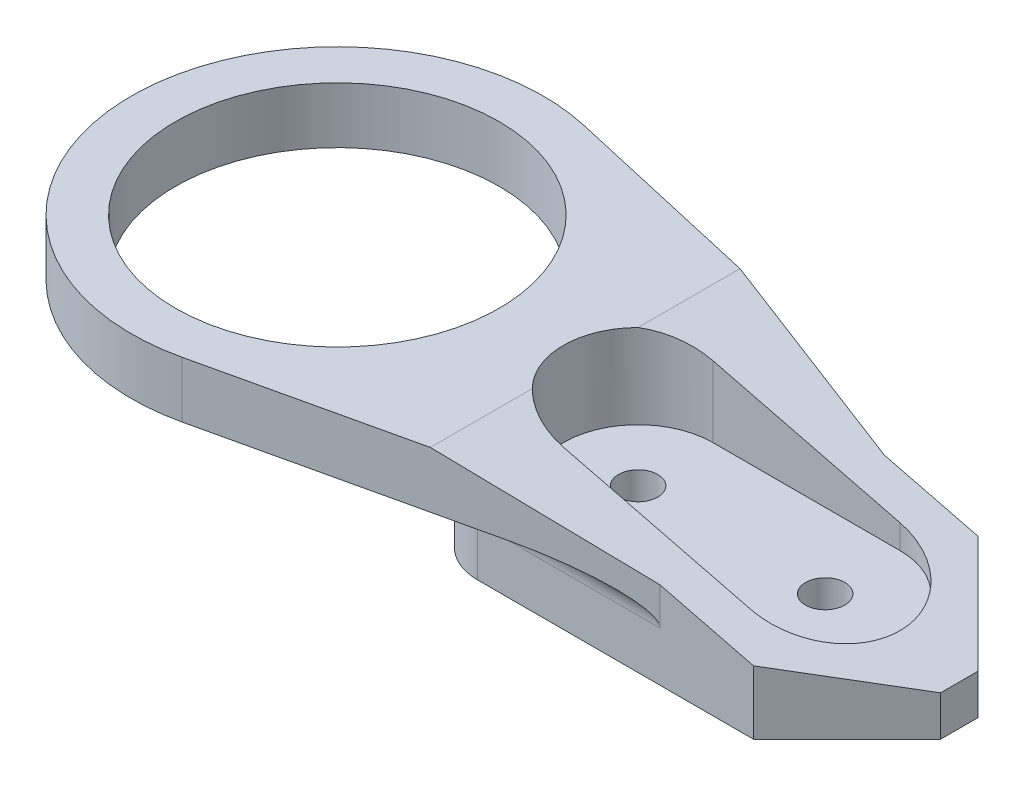
ISO-10303-21;
HEADER;
FILE_DESCRIPTION(('STEP AP214'),'2;1');
FILE_NAME('part.step','',(''),(''),'','','');
FILE_SCHEMA(('AUTOMOTIVE_DESIGN { 1 0 10303 214 1 1 1 1 }'));
ENDSEC;
DATA;
#1=APPLICATION_CONTEXT('core data for automotive mechanical design processes');
#2=APPLICATION_PROTOCOL_DEFINITION('international standard','automotive_design',2000,#1);
#3=PRODUCT_CONTEXT('',#1,'mechanical');
#4=PRODUCT('Part','Part','',(#3));
#5=PRODUCT_RELATED_PRODUCT_CATEGORY('part','',(#4));
#6=PRODUCT_DEFINITION_FORMATION('','',#4);
#7=PRODUCT_DEFINITION_CONTEXT('part definition',#1,'design');
#8=PRODUCT_DEFINITION('design','',#6,#7);
#9=PRODUCT_DEFINITION_SHAPE('','',#8);
#10=(LENGTH_UNIT() NAMED_UNIT(*) SI_UNIT(.MILLI.,.METRE.));
#11=(NAMED_UNIT(*) PLANE_ANGLE_UNIT() SI_UNIT($,.RADIAN.));
#12=(NAMED_UNIT(*) SI_UNIT($,.STERADIAN.) SOLID_ANGLE_UNIT());
#13=UNCERTAINTY_MEASURE_WITH_UNIT(LENGTH_MEASURE(1.E-05),#10,'distance_accuracy_value','');
#14=(GEOMETRIC_REPRESENTATION_CONTEXT(3) GLOBAL_UNCERTAINTY_ASSIGNED_CONTEXT((#13)) GLOBAL_UNIT_ASSIGNED_CONTEXT((#10,
#11,#12)) REPRESENTATION_CONTEXT('',''));
#15=CARTESIAN_POINT('',(0.,0.,0.));
#16=DIRECTION('',(0.,0.,1.));
#17=DIRECTION('',(1.,0.,0.));
#18=AXIS2_PLACEMENT_3D('',#15,#16,#17);
#19=CARTESIAN_POINT('',(17.8298933663439,-2.85,6.));
#20=DIRECTION('',(0.,1.,0.));
#21=DIRECTION('',(0.,0.,1.));
#22=AXIS2_PLACEMENT_3D('',#19,#20,#21);
#23=CYLINDRICAL_SURFACE('',#22,1.05);
#24=CARTESIAN_POINT('',(17.8298933663439,0.,6.));
#25=DIRECTION('',(0.,1.,0.));
#26=DIRECTION('',(-1.,0.,0.));
#27=AXIS2_PLACEMENT_3D('',#24,#25,#26);
#28=CIRCLE('',#27,1.05);
#29=CARTESIAN_POINT('',(16.7798933663439,0.,6.));
#30=VERTEX_POINT('',#29);
#31=EDGE_CURVE('E235',#30,#30,#28,.T.);
#32=ORIENTED_EDGE('',*,*,#31,.F.);
#33=EDGE_LOOP('',(#32));
#34=FACE_BOUND('',#33,.T.);
#35=CARTESIAN_POINT('',(17.8298933663439,2.65,6.));
#36=DIRECTION('',(0.,1.,0.));
#37=DIRECTION('',(0.,0.,1.));
#38=AXIS2_PLACEMENT_3D('',#35,#36,#37);
#39=CIRCLE('',#38,1.05);
#40=CARTESIAN_POINT('',(17.8298933663439,2.65,7.05));
#41=VERTEX_POINT('',#40);
#42=EDGE_CURVE('E232',#41,#41,#39,.F.);
#43=ORIENTED_EDGE('',*,*,#42,.F.);
#44=EDGE_LOOP('',(#43));
#45=FACE_BOUND('',#44,.T.);
#46=ADVANCED_FACE('F47',(#34,#45),#23,.F.);
#47=CARTESIAN_POINT('',(7.82989336634394,-2.85,6.));
#48=DIRECTION('',(0.,1.,0.));
#49=DIRECTION('',(0.,0.,1.));
#50=AXIS2_PLACEMENT_3D('',#47,#48,#49);
#51=CYLINDRICAL_SURFACE('',#50,1.05);
#52=CARTESIAN_POINT('',(7.82989336634394,0.,6.));
#53=DIRECTION('',(0.,1.,0.));
#54=DIRECTION('',(-1.,0.,0.));
#55=AXIS2_PLACEMENT_3D('',#52,#53,#54);
#56=CIRCLE('',#55,1.05);
#57=CARTESIAN_POINT('',(6.77989336634394,0.,6.));
#58=VERTEX_POINT('',#57);
#59=EDGE_CURVE('E238',#58,#58,#56,.T.);
#60=ORIENTED_EDGE('',*,*,#59,.F.);
#61=EDGE_LOOP('',(#60));
#62=FACE_BOUND('',#61,.T.);
#63=CARTESIAN_POINT('',(7.82989336634394,2.65,6.));
#64=DIRECTION('',(0.,1.,0.));
#65=DIRECTION('',(0.,0.,1.));
#66=AXIS2_PLACEMENT_3D('',#63,#64,#65);
#67=CIRCLE('',#66,1.05);
#68=CARTESIAN_POINT('',(7.82989336634394,2.65,7.05));
#69=VERTEX_POINT('',#68);
#70=EDGE_CURVE('E227',#69,#69,#67,.F.);
#71=ORIENTED_EDGE('',*,*,#70,.F.);
#72=EDGE_LOOP('',(#71));
#73=FACE_BOUND('',#72,.T.);
#74=ADVANCED_FACE('F467',(#62,#73),#51,.F.);
#75=CARTESIAN_POINT('',(0.,0.,12.));
#76=DIRECTION('',(0.,0.,-1.));
#77=DIRECTION('',(-1.,0.,0.));
#78=AXIS2_PLACEMENT_3D('',#75,#76,#77);
#79=PLANE('',#78);
#80=DIRECTION('',(0.,1.,0.));
#81=VECTOR('',#80,1.);
#82=CARTESIAN_POINT('',(15.,4.15,12.));
#83=LINE('',#82,#81);
#84=CARTESIAN_POINT('',(15.,2.65,12.));
#85=VERTEX_POINT('',#84);
#86=CARTESIAN_POINT('',(15.,4.64999999999996,12.));
#87=VERTEX_POINT('',#86);
#88=EDGE_CURVE('E267',#85,#87,#83,.T.);
#89=ORIENTED_EDGE('',*,*,#88,.F.);
#90=DIRECTION('',(1.,0.,0.));
#91=VECTOR('',#90,1.);
#92=CARTESIAN_POINT('',(5.25,2.65,12.));
#93=LINE('',#92,#91);
#94=CARTESIAN_POINT('',(5.25,2.65,12.));
#95=VERTEX_POINT('',#94);
#96=EDGE_CURVE('E351',#85,#95,#93,.F.);
#97=ORIENTED_EDGE('',*,*,#96,.T.);
#98=DIRECTION('',(0.,1.,0.));
#99=VECTOR('',#98,1.);
#100=CARTESIAN_POINT('',(5.25,0.,12.));
#101=LINE('',#100,#99);
#102=CARTESIAN_POINT('',(5.25,0.,12.));
#103=VERTEX_POINT('',#102);
#104=EDGE_CURVE('E332',#95,#103,#101,.F.);
#105=ORIENTED_EDGE('',*,*,#104,.T.);
#106=DIRECTION('',(1.,0.,0.));
#107=VECTOR('',#106,1.);
#108=CARTESIAN_POINT('',(25.,0.,12.));
#109=LINE('',#108,#107);
#110=CARTESIAN_POINT('',(20.,0.,12.));
#111=VERTEX_POINT('',#110);
#112=EDGE_CURVE('E275',#103,#111,#109,.T.);
#113=ORIENTED_EDGE('',*,*,#112,.T.);
#114=DIRECTION('',(0.,1.,0.));
#115=VECTOR('',#114,1.);
#116=CARTESIAN_POINT('',(20.,0.,12.));
#117=LINE('',#116,#115);
#118=CARTESIAN_POINT('',(20.,3.39999999999998,12.));
#119=VERTEX_POINT('',#118);
#120=EDGE_CURVE('E297',#111,#119,#117,.T.);
#121=ORIENTED_EDGE('',*,*,#120,.T.);
#122=DIRECTION('',(0.970142500145333,-0.24253562503633,0.));
#123=VECTOR('',#122,1.);
#124=CARTESIAN_POINT('',(4.99999999999971,7.15,12.));
#125=LINE('',#124,#123);
#126=EDGE_CURVE('E293',#119,#87,#125,.F.);
#127=ORIENTED_EDGE('',*,*,#126,.T.);
#128=EDGE_LOOP('',(#89,#97,#105,#113,#121,#127));
#129=FACE_BOUND('',#128,.T.);
#130=ADVANCED_FACE('F448',(#129),#79,.F.);
#131=CARTESIAN_POINT('',(25.,0.,12.));
#132=DIRECTION('',(0.,1.,0.));
#133=DIRECTION('',(-1.,0.,0.));
#134=AXIS2_PLACEMENT_3D('',#131,#132,#133);
#135=PLANE('',#134);
#136=ORIENTED_EDGE('',*,*,#59,.T.);
#137=EDGE_LOOP('',(#136));
#138=FACE_BOUND('',#137,.T.);
#139=ORIENTED_EDGE('',*,*,#31,.T.);
#140=EDGE_LOOP('',(#139));
#141=FACE_BOUND('',#140,.T.);
#142=ORIENTED_EDGE('',*,*,#112,.F.);
#143=CARTESIAN_POINT('',(5.25,0.,9.));
#144=DIRECTION('',(0.,1.,0.));
#145=DIRECTION('',(-1.,0.,0.));
#146=AXIS2_PLACEMENT_3D('',#143,#144,#145);
#147=CIRCLE('',#146,3.);
#148=CARTESIAN_POINT('',(2.25,0.,9.));
#149=VERTEX_POINT('',#148);
#150=EDGE_CURVE('E336',#103,#149,#147,.F.);
#151=ORIENTED_EDGE('',*,*,#150,.T.);
#152=DIRECTION('',(0.,0.,1.));
#153=VECTOR('',#152,1.);
#154=CARTESIAN_POINT('',(2.25,0.,12.));
#155=LINE('',#154,#153);
#156=CARTESIAN_POINT('',(2.25,0.,3.));
#157=VERTEX_POINT('',#156);
#158=EDGE_CURVE('E247',#157,#149,#155,.T.);
#159=ORIENTED_EDGE('',*,*,#158,.F.);
#160=CARTESIAN_POINT('',(5.25,0.,3.));
#161=DIRECTION('',(0.,1.,0.));
#162=DIRECTION('',(-1.,0.,0.));
#163=AXIS2_PLACEMENT_3D('',#160,#161,#162);
#164=CIRCLE('',#163,3.);
#165=CARTESIAN_POINT('',(5.25,0.,0.));
#166=VERTEX_POINT('',#165);
#167=EDGE_CURVE('E334',#157,#166,#164,.F.);
#168=ORIENTED_EDGE('',*,*,#167,.T.);
#169=DIRECTION('',(1.,0.,0.));
#170=VECTOR('',#169,1.);
#171=CARTESIAN_POINT('',(25.,0.,0.));
#172=LINE('',#171,#170);
#173=CARTESIAN_POINT('',(20.,0.,0.));
#174=VERTEX_POINT('',#173);
#175=EDGE_CURVE('E266',#166,#174,#172,.T.);
#176=ORIENTED_EDGE('',*,*,#175,.T.);
#177=DIRECTION('',(0.707106781186549,0.,0.707106781186547));
#178=VECTOR('',#177,1.);
#179=CARTESIAN_POINT('',(25.,0.,5.00000000000001));
#180=LINE('',#179,#178);
#181=CARTESIAN_POINT('',(25.,0.,5.00000000000001));
#182=VERTEX_POINT('',#181);
#183=EDGE_CURVE('E309',#174,#182,#180,.T.);
#184=ORIENTED_EDGE('',*,*,#183,.T.);
#185=DIRECTION('',(0.,0.,-1.));
#186=VECTOR('',#185,1.);
#187=CARTESIAN_POINT('',(25.,0.,12.));
#188=LINE('',#187,#186);
#189=CARTESIAN_POINT('',(25.,0.,6.99999999999997));
#190=VERTEX_POINT('',#189);
#191=EDGE_CURVE('E277',#190,#182,#188,.T.);
#192=ORIENTED_EDGE('',*,*,#191,.F.);
#193=DIRECTION('',(0.707106781186547,0.,-0.707106781186549));
#194=VECTOR('',#193,1.);
#195=CARTESIAN_POINT('',(20.,0.,12.));
#196=LINE('',#195,#194);
#197=EDGE_CURVE('E311',#190,#111,#196,.F.);
#198=ORIENTED_EDGE('',*,*,#197,.T.);
#199=EDGE_LOOP('',(#142,#151,#159,#168,#176,#184,#192,#198));
#200=FACE_BOUND('',#199,.T.);
#201=ADVANCED_FACE('F391',(#138,#141,#200),#135,.F.);
#202=CARTESIAN_POINT('',(0.,0.,0.));
#203=DIRECTION('',(0.,0.,-1.));
#204=DIRECTION('',(-1.,0.,0.));
#205=AXIS2_PLACEMENT_3D('',#202,#203,#204);
#206=PLANE('',#205);
#207=DIRECTION('',(0.,1.,0.));
#208=VECTOR('',#207,1.);
#209=CARTESIAN_POINT('',(5.25,0.,0.));
#210=LINE('',#209,#208);
#211=CARTESIAN_POINT('',(5.25,2.65,0.));
#212=VERTEX_POINT('',#211);
#213=EDGE_CURVE('E338',#166,#212,#210,.T.);
#214=ORIENTED_EDGE('',*,*,#213,.T.);
#215=DIRECTION('',(-1.,0.,0.));
#216=VECTOR('',#215,1.);
#217=CARTESIAN_POINT('',(0.,2.65,0.));
#218=LINE('',#217,#216);
#219=CARTESIAN_POINT('',(15.,2.65,0.));
#220=VERTEX_POINT('',#219);
#221=EDGE_CURVE('E358',#212,#220,#218,.F.);
#222=ORIENTED_EDGE('',*,*,#221,.T.);
#223=DIRECTION('',(0.,1.,0.));
#224=VECTOR('',#223,1.);
#225=CARTESIAN_POINT('',(15.,4.15,0.));
#226=LINE('',#225,#224);
#227=CARTESIAN_POINT('',(15.,4.64999999999996,0.));
#228=VERTEX_POINT('',#227);
#229=EDGE_CURVE('E63',#220,#228,#226,.T.);
#230=ORIENTED_EDGE('',*,*,#229,.T.);
#231=DIRECTION('',(-0.970142500145333,0.24253562503633,0.));
#232=VECTOR('',#231,1.);
#233=CARTESIAN_POINT('',(1.97647058823525,7.9058823529411,0.));
#234=LINE('',#233,#232);
#235=CARTESIAN_POINT('',(20.,3.39999999999998,0.));
#236=VERTEX_POINT('',#235);
#237=EDGE_CURVE('E287',#228,#236,#234,.F.);
#238=ORIENTED_EDGE('',*,*,#237,.T.);
#239=DIRECTION('',(0.,-1.,0.));
#240=VECTOR('',#239,1.);
#241=CARTESIAN_POINT('',(20.,0.,0.));
#242=LINE('',#241,#240);
#243=EDGE_CURVE('E314',#236,#174,#242,.T.);
#244=ORIENTED_EDGE('',*,*,#243,.T.);
#245=ORIENTED_EDGE('',*,*,#175,.F.);
#246=EDGE_LOOP('',(#214,#222,#230,#238,#244,#245));
#247=FACE_BOUND('',#246,.T.);
#248=ADVANCED_FACE('F383',(#247),#206,.T.);
#249=CARTESIAN_POINT('',(25.,7.15,12.));
#250=DIRECTION('',(-1.,0.,0.));
#251=DIRECTION('',(0.,0.,1.));
#252=AXIS2_PLACEMENT_3D('',#249,#250,#251);
#253=PLANE('',#252);
#254=DIRECTION('',(0.,0.,1.));
#255=VECTOR('',#254,1.);
#256=CARTESIAN_POINT('',(25.,2.14999999999999,12.));
#257=LINE('',#256,#255);
#258=CARTESIAN_POINT('',(25.,2.14999999999999,5.00000000000001));
#259=VERTEX_POINT('',#258);
#260=CARTESIAN_POINT('',(25.,2.14999999999999,6.99999999999997));
#261=VERTEX_POINT('',#260);
#262=EDGE_CURVE('E290',#259,#261,#257,.T.);
#263=ORIENTED_EDGE('',*,*,#262,.T.);
#264=DIRECTION('',(0.,-1.,0.));
#265=VECTOR('',#264,1.);
#266=CARTESIAN_POINT('',(25.,7.15,6.99999999999997));
#267=LINE('',#266,#265);
#268=EDGE_CURVE('E307',#261,#190,#267,.T.);
#269=ORIENTED_EDGE('',*,*,#268,.T.);
#270=ORIENTED_EDGE('',*,*,#191,.T.);
#271=DIRECTION('',(0.,1.,0.));
#272=VECTOR('',#271,1.);
#273=CARTESIAN_POINT('',(25.,2.14999999999999,5.00000000000001));
#274=LINE('',#273,#272);
#275=EDGE_CURVE('E304',#182,#259,#274,.T.);
#276=ORIENTED_EDGE('',*,*,#275,.T.);
#277=EDGE_LOOP('',(#263,#269,#270,#276));
#278=FACE_BOUND('',#277,.T.);
#279=ADVANCED_FACE('F442',(#278),#253,.F.);
#280=CARTESIAN_POINT('',(0.,7.15,12.));
#281=DIRECTION('',(0.,-1.,0.));
#282=DIRECTION('',(0.,0.,-1.));
#283=AXIS2_PLACEMENT_3D('',#280,#281,#282);
#284=PLANE('',#283);
#285=CARTESIAN_POINT('',(-8.25,7.15,6.));
#286=DIRECTION('',(0.,-1.,0.));
#287=DIRECTION('',(0.,0.,-1.));
#288=AXIS2_PLACEMENT_3D('',#285,#286,#287);
#289=CIRCLE('',#288,8.65);
#290=CARTESIAN_POINT('',(-8.25,7.15,-2.65));
#291=VERTEX_POINT('',#290);
#292=EDGE_CURVE('E244',#291,#291,#289,.T.);
#293=ORIENTED_EDGE('',*,*,#292,.T.);
#294=EDGE_LOOP('',(#293));
#295=FACE_BOUND('',#294,.T.);
#296=DIRECTION('',(0.,0.,-1.));
#297=VECTOR('',#296,1.);
#298=CARTESIAN_POINT('',(4.99999999999971,7.15,12.));
#299=LINE('',#298,#297);
#300=CARTESIAN_POINT('',(4.99999999999971,7.15,14.2771102196746));
#301=VERTEX_POINT('',#300);
#302=CARTESIAN_POINT('',(4.99999999999971,7.15,8.82696012266195));
#303=VERTEX_POINT('',#302);
#304=EDGE_CURVE('E282',#301,#303,#299,.T.);
#305=ORIENTED_EDGE('',*,*,#304,.T.);
#306=CARTESIAN_POINT('',(7.82989336634394,7.15,6.));
#307=DIRECTION('',(0.,1.,0.));
#308=DIRECTION('',(0.,0.,1.));
#309=AXIS2_PLACEMENT_3D('',#306,#307,#308);
#310=CIRCLE('',#309,4.);
#311=CARTESIAN_POINT('',(4.99999999999971,7.15,3.17303987733804));
#312=VERTEX_POINT('',#311);
#313=EDGE_CURVE('E219',#312,#303,#310,.T.);
#314=ORIENTED_EDGE('',*,*,#313,.F.);
#315=CARTESIAN_POINT('',(4.99999999999971,7.15,-2.27711021967455));
#316=VERTEX_POINT('',#315);
#317=EDGE_CURVE('E281',#312,#316,#299,.T.);
#318=ORIENTED_EDGE('',*,*,#317,.T.);
#319=DIRECTION('',(-0.975040415413256,0.,-0.222027449453318));
#320=VECTOR('',#319,1.);
#321=CARTESIAN_POINT('',(0.739442824661187,7.15,-3.24728604822164));
#322=LINE('',#321,#320);
#323=CARTESIAN_POINT('',(-5.80494920248651,7.15,-4.73751624487906));
#324=VERTEX_POINT('',#323);
#325=EDGE_CURVE('E250',#316,#324,#322,.T.);
#326=ORIENTED_EDGE('',*,*,#325,.T.);
#327=CARTESIAN_POINT('',(-8.25,7.15,6.));
#328=DIRECTION('',(0.,1.,0.));
#329=DIRECTION('',(0.,0.,1.));
#330=AXIS2_PLACEMENT_3D('',#327,#328,#329);
#331=CIRCLE('',#330,11.0123806922692);
#332=CARTESIAN_POINT('',(-5.80494920248651,7.15,16.7375162448791));
#333=VERTEX_POINT('',#332);
#334=EDGE_CURVE('E261',#324,#333,#331,.T.);
#335=ORIENTED_EDGE('',*,*,#334,.T.);
#336=DIRECTION('',(-0.975040415413256,0.,0.222027449453318));
#337=VECTOR('',#336,1.);
#338=CARTESIAN_POINT('',(3.3372716632385,7.15,14.6557317884927));
#339=LINE('',#338,#337);
#340=EDGE_CURVE('E254',#301,#333,#339,.T.);
#341=ORIENTED_EDGE('',*,*,#340,.F.);
#342=EDGE_LOOP('',(#305,#314,#318,#326,#335,#341));
#343=FACE_BOUND('',#342,.T.);
#344=ADVANCED_FACE('F425',(#295,#343),#284,.F.);
#345=CARTESIAN_POINT('',(0.739442824661187,4.15,-3.24728604822164));
#346=DIRECTION('',(0.222027449453318,0.,-0.975040415413256));
#347=DIRECTION('',(-0.975040415413256,0.,-0.222027449453318));
#348=AXIS2_PLACEMENT_3D('',#345,#346,#347);
#349=PLANE('',#348);
#350=ORIENTED_EDGE('',*,*,#325,.F.);
#351=DIRECTION('',(-0.947302626103098,0.236825656525771,-0.215711249102385));
#352=VECTOR('',#351,1.);
#353=CARTESIAN_POINT('',(1.65143880185032,7.98714029953734,-3.0396145122257));
#354=LINE('',#353,#352);
#355=EDGE_CURVE('E285',#316,#228,#354,.F.);
#356=ORIENTED_EDGE('',*,*,#355,.T.);
#357=ORIENTED_EDGE('',*,*,#229,.F.);
#358=CARTESIAN_POINT('',(8.41270357912484,2.65,-1.5));
#359=DIRECTION('',(0.222027449453318,0.,-0.975040415413256));
#360=DIRECTION('',(-0.975040415413256,0.,-0.222027449453318));
#361=AXIS2_PLACEMENT_3D('',#358,#359,#360);
#362=ELLIPSE('',#361,6.75592141284034,1.5);
#363=CARTESIAN_POINT('',(8.41270357912484,4.15,-1.5));
#364=VERTEX_POINT('',#363);
#365=EDGE_CURVE('E11',#220,#364,#362,.F.);
#366=ORIENTED_EDGE('',*,*,#365,.T.);
#367=DIRECTION('',(-0.975040415413256,0.,-0.222027449453318));
#368=VECTOR('',#367,1.);
#369=CARTESIAN_POINT('',(0.739442824661187,4.15,-3.24728604822164));
#370=LINE('',#369,#368);
#371=CARTESIAN_POINT('',(-5.80494920248651,4.15,-4.73751624487906));
#372=VERTEX_POINT('',#371);
#373=EDGE_CURVE('E251',#364,#372,#370,.T.);
#374=ORIENTED_EDGE('',*,*,#373,.T.);
#375=DIRECTION('',(0.,1.,0.));
#376=VECTOR('',#375,1.);
#377=CARTESIAN_POINT('',(-5.80494920248651,4.15,-4.73751624487906));
#378=LINE('',#377,#376);
#379=EDGE_CURVE('E259',#372,#324,#378,.T.);
#380=ORIENTED_EDGE('',*,*,#379,.T.);
#381=EDGE_LOOP('',(#350,#356,#357,#366,#374,#380));
#382=FACE_BOUND('',#381,.T.);
#383=ADVANCED_FACE('F423',(#382),#349,.T.);
#384=CARTESIAN_POINT('',(3.3372716632385,4.15,14.6557317884927));
#385=DIRECTION('',(-0.222027449453318,0.,-0.975040415413256));
#386=DIRECTION('',(-0.975040415413256,0.,0.222027449453318));
#387=AXIS2_PLACEMENT_3D('',#384,#385,#386);
#388=PLANE('',#387);
#389=ORIENTED_EDGE('',*,*,#88,.T.);
#390=DIRECTION('',(0.947302626103098,-0.236825656525771,-0.215711249102385));
#391=VECTOR('',#390,1.);
#392=CARTESIAN_POINT('',(5.46531342989284,7.03367164252672,14.1711532230184));
#393=LINE('',#392,#391);
#394=EDGE_CURVE('E295',#87,#301,#393,.F.);
#395=ORIENTED_EDGE('',*,*,#394,.T.);
#396=ORIENTED_EDGE('',*,*,#340,.T.);
#397=DIRECTION('',(0.,1.,0.));
#398=VECTOR('',#397,1.);
#399=CARTESIAN_POINT('',(-5.80494920248651,4.15,16.7375162448791));
#400=LINE('',#399,#398);
#401=CARTESIAN_POINT('',(-5.80494920248651,4.15,16.7375162448791));
#402=VERTEX_POINT('',#401);
#403=EDGE_CURVE('E270',#402,#333,#400,.T.);
#404=ORIENTED_EDGE('',*,*,#403,.F.);
#405=DIRECTION('',(-0.975040415413256,0.,0.222027449453318));
#406=VECTOR('',#405,1.);
#407=CARTESIAN_POINT('',(3.3372716632385,4.15,14.6557317884927));
#408=LINE('',#407,#406);
#409=CARTESIAN_POINT('',(8.41270357912485,4.15,13.5));
#410=VERTEX_POINT('',#409);
#411=EDGE_CURVE('E257',#410,#402,#408,.T.);
#412=ORIENTED_EDGE('',*,*,#411,.F.);
#413=CARTESIAN_POINT('',(8.41270357912485,2.65,13.5));
#414=DIRECTION('',(-0.222027449453318,0.,-0.975040415413256));
#415=DIRECTION('',(-0.975040415413256,0.,0.222027449453318));
#416=AXIS2_PLACEMENT_3D('',#413,#414,#415);
#417=ELLIPSE('',#416,6.75592141284034,1.5);
#418=EDGE_CURVE('E56',#410,#85,#417,.T.);
#419=ORIENTED_EDGE('',*,*,#418,.T.);
#420=EDGE_LOOP('',(#389,#395,#396,#404,#412,#419));
#421=FACE_BOUND('',#420,.T.);
#422=ADVANCED_FACE('F415',(#421),#388,.F.);
#423=CARTESIAN_POINT('',(-8.25,4.15,6.));
#424=DIRECTION('',(0.,1.,0.));
#425=DIRECTION('',(0.,0.,1.));
#426=AXIS2_PLACEMENT_3D('',#423,#424,#425);
#427=CYLINDRICAL_SURFACE('',#426,11.0123806922692);
#428=ORIENTED_EDGE('',*,*,#334,.F.);
#429=ORIENTED_EDGE('',*,*,#379,.F.);
#430=CARTESIAN_POINT('',(-8.25,4.15,6.));
#431=DIRECTION('',(0.,1.,0.));
#432=DIRECTION('',(0.,0.,1.));
#433=AXIS2_PLACEMENT_3D('',#430,#431,#432);
#434=CIRCLE('',#433,11.0123806922692);
#435=EDGE_CURVE('E253',#372,#402,#434,.T.);
#436=ORIENTED_EDGE('',*,*,#435,.T.);
#437=ORIENTED_EDGE('',*,*,#403,.T.);
#438=EDGE_LOOP('',(#428,#429,#436,#437));
#439=FACE_BOUND('',#438,.T.);
#440=ADVANCED_FACE('F420',(#439),#427,.T.);
#441=CARTESIAN_POINT('',(0.,4.15,0.));
#442=DIRECTION('',(0.,1.,0.));
#443=DIRECTION('',(0.,0.,1.));
#444=AXIS2_PLACEMENT_3D('',#441,#442,#443);
#445=PLANE('',#444);
#446=CARTESIAN_POINT('',(-8.25,4.15,6.));
#447=DIRECTION('',(0.,-1.,0.));
#448=DIRECTION('',(0.,0.,-1.));
#449=AXIS2_PLACEMENT_3D('',#446,#447,#448);
#450=CIRCLE('',#449,8.65);
#451=CARTESIAN_POINT('',(-8.25,4.15,-2.65));
#452=VERTEX_POINT('',#451);
#453=EDGE_CURVE('E241',#452,#452,#450,.T.);
#454=ORIENTED_EDGE('',*,*,#453,.F.);
#455=EDGE_LOOP('',(#454));
#456=FACE_BOUND('',#455,.T.);
#457=CARTESIAN_POINT('',(5.25,4.15,9.));
#458=DIRECTION('',(0.,1.,0.));
#459=DIRECTION('',(0.,0.,1.));
#460=AXIS2_PLACEMENT_3D('',#457,#458,#459);
#461=CIRCLE('',#460,4.5);
#462=CARTESIAN_POINT('',(0.75,4.15,9.));
#463=VERTEX_POINT('',#462);
#464=CARTESIAN_POINT('',(5.25,4.15,13.5));
#465=VERTEX_POINT('',#464);
#466=EDGE_CURVE('E346',#463,#465,#461,.T.);
#467=ORIENTED_EDGE('',*,*,#466,.T.);
#468=DIRECTION('',(1.,0.,0.));
#469=VECTOR('',#468,1.);
#470=CARTESIAN_POINT('',(15.,4.15,13.5));
#471=LINE('',#470,#469);
#472=EDGE_CURVE('E348',#465,#410,#471,.T.);
#473=ORIENTED_EDGE('',*,*,#472,.T.);
#474=ORIENTED_EDGE('',*,*,#411,.T.);
#475=ORIENTED_EDGE('',*,*,#435,.F.);
#476=ORIENTED_EDGE('',*,*,#373,.F.);
#477=DIRECTION('',(-1.,0.,0.));
#478=VECTOR('',#477,1.);
#479=CARTESIAN_POINT('',(0.,4.15,-1.5));
#480=LINE('',#479,#478);
#481=CARTESIAN_POINT('',(5.25,4.15,-1.5));
#482=VERTEX_POINT('',#481);
#483=EDGE_CURVE('E340',#364,#482,#480,.T.);
#484=ORIENTED_EDGE('',*,*,#483,.T.);
#485=CARTESIAN_POINT('',(5.25,4.15,3.));
#486=DIRECTION('',(0.,1.,0.));
#487=DIRECTION('',(0.,0.,1.));
#488=AXIS2_PLACEMENT_3D('',#485,#486,#487);
#489=CIRCLE('',#488,4.5);
#490=CARTESIAN_POINT('',(0.75,4.15,3.));
#491=VERTEX_POINT('',#490);
#492=EDGE_CURVE('E342',#482,#491,#489,.T.);
#493=ORIENTED_EDGE('',*,*,#492,.T.);
#494=DIRECTION('',(0.,0.,1.));
#495=VECTOR('',#494,1.);
#496=CARTESIAN_POINT('',(0.75,4.15,0.));
#497=LINE('',#496,#495);
#498=EDGE_CURVE('E344',#491,#463,#497,.T.);
#499=ORIENTED_EDGE('',*,*,#498,.T.);
#500=EDGE_LOOP('',(#467,#473,#474,#475,#476,#484,#493,#499));
#501=FACE_BOUND('',#500,.T.);
#502=ADVANCED_FACE('F411',(#456,#501),#445,.F.);
#503=CARTESIAN_POINT('',(2.25,-16.85,6.));
#504=DIRECTION('',(-1.,0.,0.));
#505=DIRECTION('',(0.,0.,1.));
#506=AXIS2_PLACEMENT_3D('',#503,#504,#505);
#507=PLANE('',#506);
#508=DIRECTION('',(0.,1.,0.));
#509=VECTOR('',#508,1.);
#510=CARTESIAN_POINT('',(2.25,4.15,9.));
#511=LINE('',#510,#509);
#512=CARTESIAN_POINT('',(2.25,2.65,9.));
#513=VERTEX_POINT('',#512);
#514=EDGE_CURVE('E329',#149,#513,#511,.T.);
#515=ORIENTED_EDGE('',*,*,#514,.T.);
#516=DIRECTION('',(0.,0.,1.));
#517=VECTOR('',#516,1.);
#518=CARTESIAN_POINT('',(2.25,2.65,6.));
#519=LINE('',#518,#517);
#520=CARTESIAN_POINT('',(2.25,2.65,3.));
#521=VERTEX_POINT('',#520);
#522=EDGE_CURVE('E355',#513,#521,#519,.F.);
#523=ORIENTED_EDGE('',*,*,#522,.T.);
#524=DIRECTION('',(0.,1.,0.));
#525=VECTOR('',#524,1.);
#526=CARTESIAN_POINT('',(2.25,-16.85,3.));
#527=LINE('',#526,#525);
#528=EDGE_CURVE('E327',#521,#157,#527,.F.);
#529=ORIENTED_EDGE('',*,*,#528,.T.);
#530=ORIENTED_EDGE('',*,*,#158,.T.);
#531=EDGE_LOOP('',(#515,#523,#529,#530));
#532=FACE_BOUND('',#531,.T.);
#533=ADVANCED_FACE('F395',(#532),#507,.T.);
#534=CARTESIAN_POINT('',(-8.25,14.15,6.));
#535=DIRECTION('',(0.,-1.,0.));
#536=DIRECTION('',(0.,0.,-1.));
#537=AXIS2_PLACEMENT_3D('',#534,#535,#536);
#538=CYLINDRICAL_SURFACE('',#537,8.65);
#539=ORIENTED_EDGE('',*,*,#453,.T.);
#540=EDGE_LOOP('',(#539));
#541=FACE_BOUND('',#540,.T.);
#542=ORIENTED_EDGE('',*,*,#292,.F.);
#543=EDGE_LOOP('',(#542));
#544=FACE_BOUND('',#543,.T.);
#545=ADVANCED_FACE('F478',(#541,#544),#538,.F.);
#546=CARTESIAN_POINT('',(4.99999999999971,7.15,12.));
#547=DIRECTION('',(-0.24253562503633,-0.970142500145333,0.));
#548=DIRECTION('',(0.,0.,-1.));
#549=AXIS2_PLACEMENT_3D('',#546,#547,#548);
#550=PLANE('',#549);
#551=CARTESIAN_POINT('',(7.82989336634394,6.44252665841395,6.));
#552=DIRECTION('',(-0.24253562503633,-0.970142500145333,0.));
#553=DIRECTION('',(-0.970142500145333,0.24253562503633,0.));
#554=AXIS2_PLACEMENT_3D('',#551,#552,#553);
#555=ELLIPSE('',#554,4.12310562561766,4.);
#556=CARTESIAN_POINT('',(7.82989336634394,6.44252665841395,10.));
#557=VERTEX_POINT('',#556);
#558=EDGE_CURVE('E201',#303,#557,#555,.F.);
#559=ORIENTED_EDGE('',*,*,#558,.F.);
#560=ORIENTED_EDGE('',*,*,#304,.F.);
#561=ORIENTED_EDGE('',*,*,#394,.F.);
#562=ORIENTED_EDGE('',*,*,#126,.F.);
#563=DIRECTION('',(0.696310623822791,-0.174077655955695,-0.696310623822793));
#564=VECTOR('',#563,1.);
#565=CARTESIAN_POINT('',(12.2727272727271,5.33181818181817,19.7272727272729));
#566=LINE('',#565,#564);
#567=EDGE_CURVE('E302',#119,#261,#566,.T.);
#568=ORIENTED_EDGE('',*,*,#567,.T.);
#569=ORIENTED_EDGE('',*,*,#262,.F.);
#570=DIRECTION('',(0.696310623822793,-0.174077655955696,0.696310623822791));
#571=VECTOR('',#570,1.);
#572=CARTESIAN_POINT('',(18.0909090909089,3.87727272727274,-1.90909090909105));
#573=LINE('',#572,#571);
#574=EDGE_CURVE('E300',#259,#236,#573,.F.);
#575=ORIENTED_EDGE('',*,*,#574,.T.);
#576=ORIENTED_EDGE('',*,*,#237,.F.);
#577=ORIENTED_EDGE('',*,*,#355,.F.);
#578=ORIENTED_EDGE('',*,*,#317,.F.);
#579=CARTESIAN_POINT('',(7.82989336634394,6.44252665841395,2.));
#580=VERTEX_POINT('',#579);
#581=EDGE_CURVE('E325',#580,#312,#555,.F.);
#582=ORIENTED_EDGE('',*,*,#581,.F.);
#583=DIRECTION('',(0.970142500145333,-0.24253562503633,0.));
#584=VECTOR('',#583,1.);
#585=CARTESIAN_POINT('',(4.99999999999971,7.15,2.));
#586=LINE('',#585,#584);
#587=CARTESIAN_POINT('',(17.8298933663439,3.94252665841398,2.));
#588=VERTEX_POINT('',#587);
#589=EDGE_CURVE('E323',#588,#580,#586,.F.);
#590=ORIENTED_EDGE('',*,*,#589,.F.);
#591=CARTESIAN_POINT('',(17.8298933663439,3.94252665841398,6.));
#592=DIRECTION('',(-0.24253562503633,-0.970142500145333,0.));
#593=DIRECTION('',(-0.970142500145333,0.24253562503633,0.));
#594=AXIS2_PLACEMENT_3D('',#591,#592,#593);
#595=ELLIPSE('',#594,4.12310562561766,4.);
#596=CARTESIAN_POINT('',(17.8298933663439,3.94252665841398,10.));
#597=VERTEX_POINT('',#596);
#598=EDGE_CURVE('E321',#597,#588,#595,.F.);
#599=ORIENTED_EDGE('',*,*,#598,.F.);
#600=DIRECTION('',(-0.970142500145333,0.24253562503633,0.));
#601=VECTOR('',#600,1.);
#602=CARTESIAN_POINT('',(4.99999999999971,7.15,10.));
#603=LINE('',#602,#601);
#604=EDGE_CURVE('E317',#557,#597,#603,.F.);
#605=ORIENTED_EDGE('',*,*,#604,.F.);
#606=EDGE_LOOP('',(#559,#560,#561,#562,#568,#569,#575,#576,#577,#578,#582,#590,#599,#605));
#607=FACE_BOUND('',#606,.T.);
#608=ADVANCED_FACE('F432',(#607),#550,.F.);
#609=CARTESIAN_POINT('',(20.,0.,12.));
#610=DIRECTION('',(-0.707106781186549,0.,-0.707106781186547));
#611=DIRECTION('',(0.,1.,0.));
#612=AXIS2_PLACEMENT_3D('',#609,#610,#611);
#613=PLANE('',#612);
#614=ORIENTED_EDGE('',*,*,#197,.F.);
#615=ORIENTED_EDGE('',*,*,#268,.F.);
#616=ORIENTED_EDGE('',*,*,#567,.F.);
#617=ORIENTED_EDGE('',*,*,#120,.F.);
#618=EDGE_LOOP('',(#614,#615,#616,#617));
#619=FACE_BOUND('',#618,.T.);
#620=ADVANCED_FACE('F445',(#619),#613,.F.);
#621=CARTESIAN_POINT('',(25.,7.15,5.00000000000001));
#622=DIRECTION('',(0.707106781186547,0.,-0.707106781186549));
#623=DIRECTION('',(0.,-1.,0.));
#624=AXIS2_PLACEMENT_3D('',#621,#622,#623);
#625=PLANE('',#624);
#626=ORIENTED_EDGE('',*,*,#183,.F.);
#627=ORIENTED_EDGE('',*,*,#243,.F.);
#628=ORIENTED_EDGE('',*,*,#574,.F.);
#629=ORIENTED_EDGE('',*,*,#275,.F.);
#630=EDGE_LOOP('',(#626,#627,#628,#629));
#631=FACE_BOUND('',#630,.T.);
#632=ADVANCED_FACE('F437',(#631),#625,.T.);
#633=CARTESIAN_POINT('',(7.82989336634394,2.65,6.));
#634=DIRECTION('',(0.,1.,0.));
#635=DIRECTION('',(0.,0.,1.));
#636=AXIS2_PLACEMENT_3D('',#633,#634,#635);
#637=PLANE('',#636);
#638=CARTESIAN_POINT('',(7.82989336634394,2.65,6.));
#639=DIRECTION('',(0.,1.,0.));
#640=DIRECTION('',(0.,0.,1.));
#641=AXIS2_PLACEMENT_3D('',#638,#639,#640);
#642=CIRCLE('',#641,4.);
#643=CARTESIAN_POINT('',(7.82989336634394,2.65,2.));
#644=VERTEX_POINT('',#643);
#645=CARTESIAN_POINT('',(7.82989336634394,2.65,10.));
#646=VERTEX_POINT('',#645);
#647=EDGE_CURVE('E198',#644,#646,#642,.T.);
#648=ORIENTED_EDGE('',*,*,#647,.T.);
#649=DIRECTION('',(1.,0.,0.));
#650=VECTOR('',#649,1.);
#651=CARTESIAN_POINT('',(17.8298933663439,2.65,10.));
#652=LINE('',#651,#650);
#653=CARTESIAN_POINT('',(17.8298933663439,2.65,10.));
#654=VERTEX_POINT('',#653);
#655=EDGE_CURVE('E208',#646,#654,#652,.T.);
#656=ORIENTED_EDGE('',*,*,#655,.T.);
#657=CARTESIAN_POINT('',(17.8298933663439,2.65,6.));
#658=DIRECTION('',(0.,1.,0.));
#659=DIRECTION('',(0.,0.,1.));
#660=AXIS2_PLACEMENT_3D('',#657,#658,#659);
#661=CIRCLE('',#660,4.);
#662=CARTESIAN_POINT('',(17.8298933663439,2.65,2.));
#663=VERTEX_POINT('',#662);
#664=EDGE_CURVE('E214',#654,#663,#661,.T.);
#665=ORIENTED_EDGE('',*,*,#664,.T.);
#666=DIRECTION('',(-1.,0.,0.));
#667=VECTOR('',#666,1.);
#668=CARTESIAN_POINT('',(7.82989336634394,2.65,2.));
#669=LINE('',#668,#667);
#670=EDGE_CURVE('E205',#663,#644,#669,.T.);
#671=ORIENTED_EDGE('',*,*,#670,.T.);
#672=EDGE_LOOP('',(#648,#656,#665,#671));
#673=FACE_BOUND('',#672,.T.);
#674=ORIENTED_EDGE('',*,*,#70,.T.);
#675=EDGE_LOOP('',(#674));
#676=FACE_BOUND('',#675,.T.);
#677=ORIENTED_EDGE('',*,*,#42,.T.);
#678=EDGE_LOOP('',(#677));
#679=FACE_BOUND('',#678,.T.);
#680=ADVANCED_FACE('F216',(#673,#676,#679),#637,.T.);
#681=CARTESIAN_POINT('',(7.82989336634394,2.65,6.));
#682=DIRECTION('',(0.,1.,0.));
#683=DIRECTION('',(0.,0.,1.));
#684=AXIS2_PLACEMENT_3D('',#681,#682,#683);
#685=CYLINDRICAL_SURFACE('',#684,4.);
#686=ORIENTED_EDGE('',*,*,#558,.T.);
#687=DIRECTION('',(0.,1.,0.));
#688=VECTOR('',#687,1.);
#689=CARTESIAN_POINT('',(7.82989336634394,2.65,10.));
#690=LINE('',#689,#688);
#691=EDGE_CURVE('E193',#646,#557,#690,.T.);
#692=ORIENTED_EDGE('',*,*,#691,.F.);
#693=ORIENTED_EDGE('',*,*,#647,.F.);
#694=DIRECTION('',(0.,1.,0.));
#695=VECTOR('',#694,1.);
#696=CARTESIAN_POINT('',(7.82989336634394,2.65,2.));
#697=LINE('',#696,#695);
#698=EDGE_CURVE('E225',#644,#580,#697,.T.);
#699=ORIENTED_EDGE('',*,*,#698,.T.);
#700=ORIENTED_EDGE('',*,*,#581,.T.);
#701=ORIENTED_EDGE('',*,*,#313,.T.);
#702=EDGE_LOOP('',(#686,#692,#693,#699,#700,#701));
#703=FACE_BOUND('',#702,.T.);
#704=ADVANCED_FACE('F195',(#703),#685,.F.);
#705=CARTESIAN_POINT('',(7.82989336634394,2.65,2.));
#706=DIRECTION('',(0.,0.,-1.));
#707=DIRECTION('',(-1.,0.,0.));
#708=AXIS2_PLACEMENT_3D('',#705,#706,#707);
#709=PLANE('',#708);
#710=ORIENTED_EDGE('',*,*,#589,.T.);
#711=ORIENTED_EDGE('',*,*,#698,.F.);
#712=ORIENTED_EDGE('',*,*,#670,.F.);
#713=DIRECTION('',(0.,1.,0.));
#714=VECTOR('',#713,1.);
#715=CARTESIAN_POINT('',(17.8298933663439,2.65,2.));
#716=LINE('',#715,#714);
#717=EDGE_CURVE('E228',#663,#588,#716,.T.);
#718=ORIENTED_EDGE('',*,*,#717,.T.);
#719=EDGE_LOOP('',(#710,#711,#712,#718));
#720=FACE_BOUND('',#719,.T.);
#721=ADVANCED_FACE('F456',(#720),#709,.F.);
#722=CARTESIAN_POINT('',(17.8298933663439,2.65,6.));
#723=DIRECTION('',(0.,1.,0.));
#724=DIRECTION('',(0.,0.,1.));
#725=AXIS2_PLACEMENT_3D('',#722,#723,#724);
#726=CYLINDRICAL_SURFACE('',#725,4.);
#727=ORIENTED_EDGE('',*,*,#598,.T.);
#728=ORIENTED_EDGE('',*,*,#717,.F.);
#729=ORIENTED_EDGE('',*,*,#664,.F.);
#730=DIRECTION('',(0.,1.,0.));
#731=VECTOR('',#730,1.);
#732=CARTESIAN_POINT('',(17.8298933663439,2.65,10.));
#733=LINE('',#732,#731);
#734=EDGE_CURVE('E204',#654,#597,#733,.T.);
#735=ORIENTED_EDGE('',*,*,#734,.T.);
#736=EDGE_LOOP('',(#727,#728,#729,#735));
#737=FACE_BOUND('',#736,.T.);
#738=ADVANCED_FACE('F454',(#737),#726,.F.);
#739=CARTESIAN_POINT('',(17.8298933663439,2.65,10.));
#740=DIRECTION('',(0.,0.,1.));
#741=DIRECTION('',(1.,0.,0.));
#742=AXIS2_PLACEMENT_3D('',#739,#740,#741);
#743=PLANE('',#742);
#744=ORIENTED_EDGE('',*,*,#604,.T.);
#745=ORIENTED_EDGE('',*,*,#734,.F.);
#746=ORIENTED_EDGE('',*,*,#655,.F.);
#747=ORIENTED_EDGE('',*,*,#691,.T.);
#748=EDGE_LOOP('',(#744,#745,#746,#747));
#749=FACE_BOUND('',#748,.T.);
#750=ADVANCED_FACE('F209',(#749),#743,.F.);
#751=CARTESIAN_POINT('',(5.25,-16.85,9.));
#752=DIRECTION('',(0.,-1.,0.));
#753=DIRECTION('',(0.,0.,-1.));
#754=AXIS2_PLACEMENT_3D('',#751,#752,#753);
#755=CYLINDRICAL_SURFACE('',#754,3.);
#756=ORIENTED_EDGE('',*,*,#104,.F.);
#757=CARTESIAN_POINT('',(5.25,2.65,9.));
#758=DIRECTION('',(0.,1.,0.));
#759=DIRECTION('',(0.,0.,1.));
#760=AXIS2_PLACEMENT_3D('',#757,#758,#759);
#761=CIRCLE('',#760,3.);
#762=EDGE_CURVE('E353',#95,#513,#761,.F.);
#763=ORIENTED_EDGE('',*,*,#762,.T.);
#764=ORIENTED_EDGE('',*,*,#514,.F.);
#765=ORIENTED_EDGE('',*,*,#150,.F.);
#766=EDGE_LOOP('',(#756,#763,#764,#765));
#767=FACE_BOUND('',#766,.T.);
#768=ADVANCED_FACE('F398',(#767),#755,.T.);
#769=CARTESIAN_POINT('',(5.25,0.,3.));
#770=DIRECTION('',(0.,1.,0.));
#771=DIRECTION('',(0.,0.,1.));
#772=AXIS2_PLACEMENT_3D('',#769,#770,#771);
#773=CYLINDRICAL_SURFACE('',#772,3.);
#774=ORIENTED_EDGE('',*,*,#528,.F.);
#775=CARTESIAN_POINT('',(5.25,2.65,3.));
#776=DIRECTION('',(0.,1.,0.));
#777=DIRECTION('',(0.,0.,1.));
#778=AXIS2_PLACEMENT_3D('',#775,#776,#777);
#779=CIRCLE('',#778,3.);
#780=EDGE_CURVE('E71',#521,#212,#779,.F.);
#781=ORIENTED_EDGE('',*,*,#780,.T.);
#782=ORIENTED_EDGE('',*,*,#213,.F.);
#783=ORIENTED_EDGE('',*,*,#167,.F.);
#784=EDGE_LOOP('',(#774,#781,#782,#783));
#785=FACE_BOUND('',#784,.T.);
#786=ADVANCED_FACE('F387',(#785),#773,.T.);
#787=CARTESIAN_POINT('',(0.,2.65,-1.5));
#788=DIRECTION('',(-1.,0.,0.));
#789=DIRECTION('',(0.,0.,1.));
#790=AXIS2_PLACEMENT_3D('',#787,#788,#789);
#791=CYLINDRICAL_SURFACE('',#790,1.5);
#792=ORIENTED_EDGE('',*,*,#365,.F.);
#793=ORIENTED_EDGE('',*,*,#221,.F.);
#794=CARTESIAN_POINT('',(5.25,2.65,-1.5));
#795=DIRECTION('',(1.,0.,0.));
#796=DIRECTION('',(0.,0.,-1.));
#797=AXIS2_PLACEMENT_3D('',#794,#795,#796);
#798=CIRCLE('',#797,1.5);
#799=EDGE_CURVE('E51',#482,#212,#798,.T.);
#800=ORIENTED_EDGE('',*,*,#799,.F.);
#801=ORIENTED_EDGE('',*,*,#483,.F.);
#802=EDGE_LOOP('',(#792,#793,#800,#801));
#803=FACE_BOUND('',#802,.T.);
#804=ADVANCED_FACE('F49',(#803),#791,.F.);
#805=CARTESIAN_POINT('',(5.25,2.65,3.));
#806=DIRECTION('',(0.,1.,0.));
#807=DIRECTION('',(0.,0.,1.));
#808=AXIS2_PLACEMENT_3D('',#805,#806,#807);
#809=TOROIDAL_SURFACE('',#808,4.5,1.5);
#810=ORIENTED_EDGE('',*,*,#799,.T.);
#811=ORIENTED_EDGE('',*,*,#780,.F.);
#812=CARTESIAN_POINT('',(0.75,2.65,3.));
#813=DIRECTION('',(0.,0.,-1.));
#814=DIRECTION('',(-1.,0.,0.));
#815=AXIS2_PLACEMENT_3D('',#812,#813,#814);
#816=CIRCLE('',#815,1.5);
#817=EDGE_CURVE('E367',#491,#521,#816,.T.);
#818=ORIENTED_EDGE('',*,*,#817,.F.);
#819=ORIENTED_EDGE('',*,*,#492,.F.);
#820=EDGE_LOOP('',(#810,#811,#818,#819));
#821=FACE_BOUND('',#820,.T.);
#822=ADVANCED_FACE('F377',(#821),#809,.F.);
#823=CARTESIAN_POINT('',(0.75,2.65,0.));
#824=DIRECTION('',(0.,0.,1.));
#825=DIRECTION('',(1.,0.,0.));
#826=AXIS2_PLACEMENT_3D('',#823,#824,#825);
#827=CYLINDRICAL_SURFACE('',#826,1.5);
#828=ORIENTED_EDGE('',*,*,#817,.T.);
#829=ORIENTED_EDGE('',*,*,#522,.F.);
#830=CARTESIAN_POINT('',(0.75,2.65,9.));
#831=DIRECTION('',(0.,0.,-1.));
#832=DIRECTION('',(-1.,0.,0.));
#833=AXIS2_PLACEMENT_3D('',#830,#831,#832);
#834=CIRCLE('',#833,1.5);
#835=EDGE_CURVE('E365',#463,#513,#834,.T.);
#836=ORIENTED_EDGE('',*,*,#835,.F.);
#837=ORIENTED_EDGE('',*,*,#498,.F.);
#838=EDGE_LOOP('',(#828,#829,#836,#837));
#839=FACE_BOUND('',#838,.T.);
#840=ADVANCED_FACE('F528',(#839),#827,.F.);
#841=CARTESIAN_POINT('',(5.25,2.65,9.));
#842=DIRECTION('',(0.,1.,0.));
#843=DIRECTION('',(0.,0.,1.));
#844=AXIS2_PLACEMENT_3D('',#841,#842,#843);
#845=TOROIDAL_SURFACE('',#844,4.5,1.5);
#846=ORIENTED_EDGE('',*,*,#835,.T.);
#847=ORIENTED_EDGE('',*,*,#762,.F.);
#848=CARTESIAN_POINT('',(5.25,2.65,13.5));
#849=DIRECTION('',(-1.,0.,0.));
#850=DIRECTION('',(0.,0.,1.));
#851=AXIS2_PLACEMENT_3D('',#848,#849,#850);
#852=CIRCLE('',#851,1.5);
#853=EDGE_CURVE('E362',#465,#95,#852,.T.);
#854=ORIENTED_EDGE('',*,*,#853,.F.);
#855=ORIENTED_EDGE('',*,*,#466,.F.);
#856=EDGE_LOOP('',(#846,#847,#854,#855));
#857=FACE_BOUND('',#856,.T.);
#858=ADVANCED_FACE('F402',(#857),#845,.F.);
#859=CARTESIAN_POINT('',(0.,2.65,13.5));
#860=DIRECTION('',(-1.,0.,0.));
#861=DIRECTION('',(0.,0.,1.));
#862=AXIS2_PLACEMENT_3D('',#859,#860,#861);
#863=CYLINDRICAL_SURFACE('',#862,1.5);
#864=ORIENTED_EDGE('',*,*,#853,.T.);
#865=ORIENTED_EDGE('',*,*,#96,.F.);
#866=ORIENTED_EDGE('',*,*,#418,.F.);
#867=ORIENTED_EDGE('',*,*,#472,.F.);
#868=EDGE_LOOP('',(#864,#865,#866,#867));
#869=FACE_BOUND('',#868,.T.);
#870=ADVANCED_FACE('F408',(#869),#863,.F.);
#871=CLOSED_SHELL('',(#46,#74,#130,#201,#248,#279,#344,#383,#422,#440,#502,#533,#545,#608,#620,
#632,#680,#704,#721,#738,#750,#768,#786,#804,#822,#840,#858,#870));
#872=MANIFOLD_SOLID_BREP('B2',#871);
#873=ADVANCED_BREP_SHAPE_REPRESENTATION('',(#18,#872),#14);
#874=SHAPE_DEFINITION_REPRESENTATION(#9,#873);
ENDSEC;
END-ISO-10303-21;
